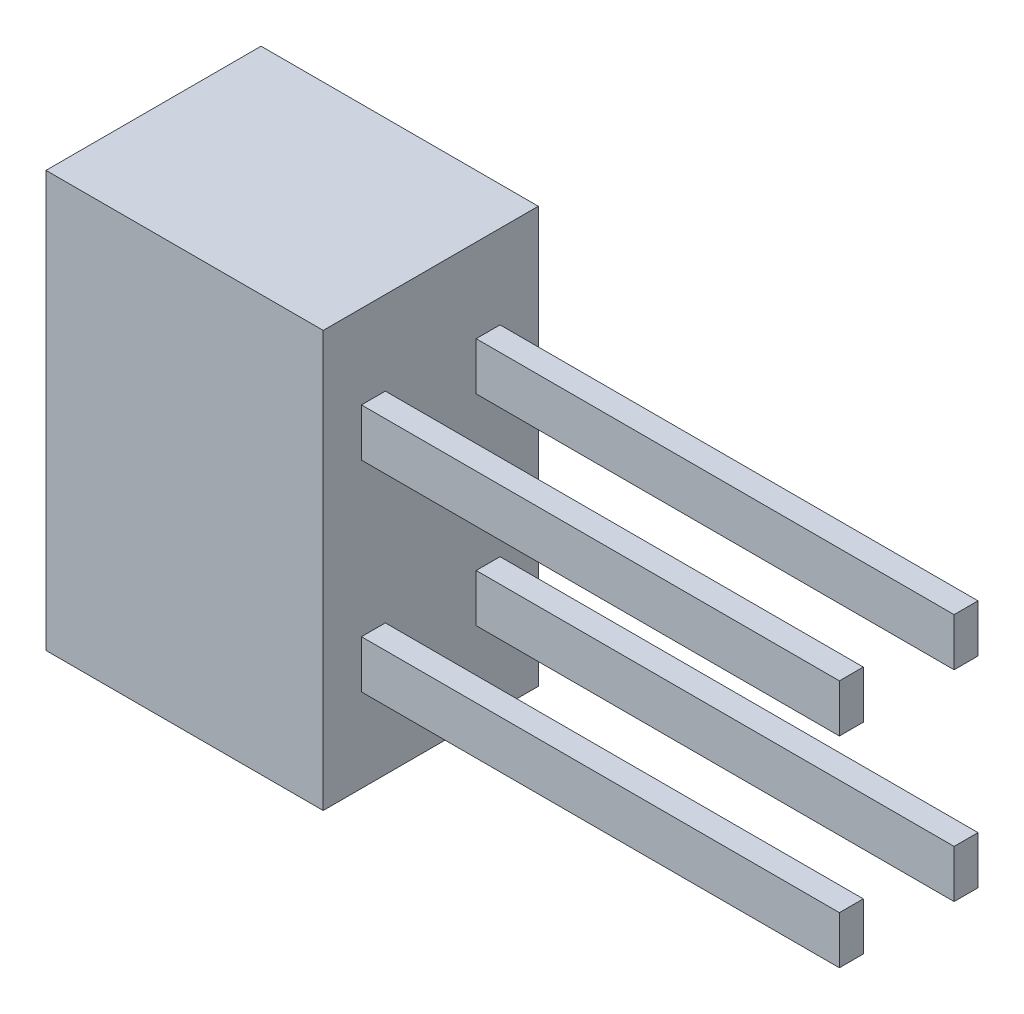
ISO-10303-21;
HEADER;
FILE_DESCRIPTION(('STEP AP214'),'2;1');
FILE_NAME('part.step','',(''),(''),'','','');
FILE_SCHEMA(('AUTOMOTIVE_DESIGN { 1 0 10303 214 1 1 1 1 }'));
ENDSEC;
DATA;
#1=APPLICATION_CONTEXT('core data for automotive mechanical design processes');
#2=APPLICATION_PROTOCOL_DEFINITION('international standard','automotive_design',2000,#1);
#3=PRODUCT_CONTEXT('',#1,'mechanical');
#4=PRODUCT('Part','Part','',(#3));
#5=PRODUCT_RELATED_PRODUCT_CATEGORY('part','',(#4));
#6=PRODUCT_DEFINITION_FORMATION('','',#4);
#7=PRODUCT_DEFINITION_CONTEXT('part definition',#1,'design');
#8=PRODUCT_DEFINITION('design','',#6,#7);
#9=PRODUCT_DEFINITION_SHAPE('','',#8);
#10=(LENGTH_UNIT() NAMED_UNIT(*) SI_UNIT(.MILLI.,.METRE.));
#11=(NAMED_UNIT(*) PLANE_ANGLE_UNIT() SI_UNIT($,.RADIAN.));
#12=(NAMED_UNIT(*) SI_UNIT($,.STERADIAN.) SOLID_ANGLE_UNIT());
#13=UNCERTAINTY_MEASURE_WITH_UNIT(LENGTH_MEASURE(1.E-05),#10,'distance_accuracy_value','');
#14=(GEOMETRIC_REPRESENTATION_CONTEXT(3) GLOBAL_UNCERTAINTY_ASSIGNED_CONTEXT((#13)) GLOBAL_UNIT_ASSIGNED_CONTEXT((#10,
#11,#12)) REPRESENTATION_CONTEXT('',''));
#15=CARTESIAN_POINT('',(0.,0.,0.));
#16=DIRECTION('',(0.,0.,1.));
#17=DIRECTION('',(1.,0.,0.));
#18=AXIS2_PLACEMENT_3D('',#15,#16,#17);
#19=CARTESIAN_POINT('',(5.8,0.,0.));
#20=DIRECTION('',(-1.,0.,0.));
#21=DIRECTION('',(0.,0.,1.));
#22=AXIS2_PLACEMENT_3D('',#19,#20,#21);
#23=PLANE('',#22);
#24=DIRECTION('',(0.,-1.,0.));
#25=VECTOR('',#24,1.);
#26=CARTESIAN_POINT('',(5.8,2.6,-0.95));
#27=LINE('',#26,#25);
#28=CARTESIAN_POINT('',(5.8,2.6,-0.95));
#29=VERTEX_POINT('',#28);
#30=CARTESIAN_POINT('',(5.8,1.6,-0.95));
#31=VERTEX_POINT('',#30);
#32=EDGE_CURVE('E192',#29,#31,#27,.T.);
#33=ORIENTED_EDGE('',*,*,#32,.F.);
#34=DIRECTION('',(0.,0.,1.));
#35=VECTOR('',#34,1.);
#36=CARTESIAN_POINT('',(5.8,2.6,-0.95));
#37=LINE('',#36,#35);
#38=CARTESIAN_POINT('',(5.8,2.6,-1.45));
#39=VERTEX_POINT('',#38);
#40=EDGE_CURVE('E205',#39,#29,#37,.T.);
#41=ORIENTED_EDGE('',*,*,#40,.F.);
#42=DIRECTION('',(0.,1.,0.));
#43=VECTOR('',#42,1.);
#44=CARTESIAN_POINT('',(5.8,2.6,-1.45));
#45=LINE('',#44,#43);
#46=CARTESIAN_POINT('',(5.8,1.6,-1.45));
#47=VERTEX_POINT('',#46);
#48=EDGE_CURVE('E214',#47,#39,#45,.T.);
#49=ORIENTED_EDGE('',*,*,#48,.F.);
#50=DIRECTION('',(0.,0.,-1.));
#51=VECTOR('',#50,1.);
#52=CARTESIAN_POINT('',(5.8,1.6,-0.95));
#53=LINE('',#52,#51);
#54=EDGE_CURVE('E195',#31,#47,#53,.T.);
#55=ORIENTED_EDGE('',*,*,#54,.F.);
#56=EDGE_LOOP('',(#33,#41,#49,#55));
#57=FACE_BOUND('',#56,.T.);
#58=DIRECTION('',(0.,1.,0.));
#59=VECTOR('',#58,1.);
#60=CARTESIAN_POINT('',(5.8,-2.6,0.95));
#61=LINE('',#60,#59);
#62=CARTESIAN_POINT('',(5.8,-2.6,0.95));
#63=VERTEX_POINT('',#62);
#64=CARTESIAN_POINT('',(5.8,-1.6,0.949999999999999));
#65=VERTEX_POINT('',#64);
#66=EDGE_CURVE('E263',#63,#65,#61,.T.);
#67=ORIENTED_EDGE('',*,*,#66,.F.);
#68=DIRECTION('',(0.,0.,-1.));
#69=VECTOR('',#68,1.);
#70=CARTESIAN_POINT('',(5.8,-2.6,0.95));
#71=LINE('',#70,#69);
#72=CARTESIAN_POINT('',(5.8,-2.6,1.45));
#73=VERTEX_POINT('',#72);
#74=EDGE_CURVE('E268',#73,#63,#71,.T.);
#75=ORIENTED_EDGE('',*,*,#74,.F.);
#76=DIRECTION('',(0.,-1.,0.));
#77=VECTOR('',#76,1.);
#78=CARTESIAN_POINT('',(5.8,-2.6,1.45));
#79=LINE('',#78,#77);
#80=CARTESIAN_POINT('',(5.8,-1.6,1.45));
#81=VERTEX_POINT('',#80);
#82=EDGE_CURVE('E280',#81,#73,#79,.T.);
#83=ORIENTED_EDGE('',*,*,#82,.F.);
#84=DIRECTION('',(0.,0.,1.));
#85=VECTOR('',#84,1.);
#86=CARTESIAN_POINT('',(5.8,-1.6,0.949999999999999));
#87=LINE('',#86,#85);
#88=EDGE_CURVE('E277',#65,#81,#87,.T.);
#89=ORIENTED_EDGE('',*,*,#88,.F.);
#90=EDGE_LOOP('',(#67,#75,#83,#89));
#91=FACE_BOUND('',#90,.T.);
#92=DIRECTION('',(0.,1.,0.));
#93=VECTOR('',#92,1.);
#94=CARTESIAN_POINT('',(5.8,-4.35,-2.25));
#95=LINE('',#94,#93);
#96=CARTESIAN_POINT('',(5.8,-4.35,-2.25));
#97=VERTEX_POINT('',#96);
#98=CARTESIAN_POINT('',(5.8,4.35,-2.25));
#99=VERTEX_POINT('',#98);
#100=EDGE_CURVE('E297',#97,#99,#95,.T.);
#101=ORIENTED_EDGE('',*,*,#100,.T.);
#102=DIRECTION('',(0.,0.,1.));
#103=VECTOR('',#102,1.);
#104=CARTESIAN_POINT('',(5.8,4.35,2.25));
#105=LINE('',#104,#103);
#106=CARTESIAN_POINT('',(5.8,4.35,2.25));
#107=VERTEX_POINT('',#106);
#108=EDGE_CURVE('E300',#99,#107,#105,.T.);
#109=ORIENTED_EDGE('',*,*,#108,.T.);
#110=DIRECTION('',(0.,-1.,0.));
#111=VECTOR('',#110,1.);
#112=CARTESIAN_POINT('',(5.8,-4.35,2.25));
#113=LINE('',#112,#111);
#114=CARTESIAN_POINT('',(5.8,-4.35,2.25));
#115=VERTEX_POINT('',#114);
#116=EDGE_CURVE('E303',#107,#115,#113,.T.);
#117=ORIENTED_EDGE('',*,*,#116,.T.);
#118=DIRECTION('',(0.,0.,-1.));
#119=VECTOR('',#118,1.);
#120=CARTESIAN_POINT('',(5.8,-4.35,2.25));
#121=LINE('',#120,#119);
#122=EDGE_CURVE('E305',#115,#97,#121,.T.);
#123=ORIENTED_EDGE('',*,*,#122,.T.);
#124=EDGE_LOOP('',(#101,#109,#117,#123));
#125=FACE_BOUND('',#124,.T.);
#126=DIRECTION('',(0.,0.,1.));
#127=VECTOR('',#126,1.);
#128=CARTESIAN_POINT('',(5.8,2.6,0.95));
#129=LINE('',#128,#127);
#130=CARTESIAN_POINT('',(5.8,2.6,0.95));
#131=VERTEX_POINT('',#130);
#132=CARTESIAN_POINT('',(5.8,2.6,1.45));
#133=VERTEX_POINT('',#132);
#134=EDGE_CURVE('E230',#131,#133,#129,.T.);
#135=ORIENTED_EDGE('',*,*,#134,.F.);
#136=DIRECTION('',(0.,1.,0.));
#137=VECTOR('',#136,1.);
#138=CARTESIAN_POINT('',(5.8,2.6,0.95));
#139=LINE('',#138,#137);
#140=CARTESIAN_POINT('',(5.8,1.6,0.949999999999999));
#141=VERTEX_POINT('',#140);
#142=EDGE_CURVE('E235',#141,#131,#139,.T.);
#143=ORIENTED_EDGE('',*,*,#142,.F.);
#144=DIRECTION('',(0.,0.,-1.));
#145=VECTOR('',#144,1.);
#146=CARTESIAN_POINT('',(5.8,1.6,0.949999999999999));
#147=LINE('',#146,#145);
#148=CARTESIAN_POINT('',(5.8,1.6,1.45));
#149=VERTEX_POINT('',#148);
#150=EDGE_CURVE('E247',#149,#141,#147,.T.);
#151=ORIENTED_EDGE('',*,*,#150,.F.);
#152=DIRECTION('',(0.,-1.,0.));
#153=VECTOR('',#152,1.);
#154=CARTESIAN_POINT('',(5.8,2.6,1.45));
#155=LINE('',#154,#153);
#156=EDGE_CURVE('E244',#133,#149,#155,.T.);
#157=ORIENTED_EDGE('',*,*,#156,.F.);
#158=EDGE_LOOP('',(#135,#143,#151,#157));
#159=FACE_BOUND('',#158,.T.);
#160=DIRECTION('',(0.,0.,-1.));
#161=VECTOR('',#160,1.);
#162=CARTESIAN_POINT('',(5.8,-2.6,-0.95));
#163=LINE('',#162,#161);
#164=CARTESIAN_POINT('',(5.8,-2.6,-0.95));
#165=VERTEX_POINT('',#164);
#166=CARTESIAN_POINT('',(5.8,-2.6,-1.45));
#167=VERTEX_POINT('',#166);
#168=EDGE_CURVE('E191',#165,#167,#163,.T.);
#169=ORIENTED_EDGE('',*,*,#168,.F.);
#170=DIRECTION('',(0.,-1.,0.));
#171=VECTOR('',#170,1.);
#172=CARTESIAN_POINT('',(5.8,-2.6,-0.95));
#173=LINE('',#172,#171);
#174=CARTESIAN_POINT('',(5.8,-1.6,-0.95));
#175=VERTEX_POINT('',#174);
#176=EDGE_CURVE('E188',#175,#165,#173,.T.);
#177=ORIENTED_EDGE('',*,*,#176,.F.);
#178=DIRECTION('',(0.,0.,1.));
#179=VECTOR('',#178,1.);
#180=CARTESIAN_POINT('',(5.8,-1.6,-0.95));
#181=LINE('',#180,#179);
#182=CARTESIAN_POINT('',(5.8,-1.6,-1.45));
#183=VERTEX_POINT('',#182);
#184=EDGE_CURVE('E54',#183,#175,#181,.T.);
#185=ORIENTED_EDGE('',*,*,#184,.F.);
#186=DIRECTION('',(0.,1.,0.));
#187=VECTOR('',#186,1.);
#188=CARTESIAN_POINT('',(5.8,-2.6,-1.45));
#189=LINE('',#188,#187);
#190=EDGE_CURVE('E49',#167,#183,#189,.T.);
#191=ORIENTED_EDGE('',*,*,#190,.F.);
#192=EDGE_LOOP('',(#169,#177,#185,#191));
#193=FACE_BOUND('',#192,.T.);
#194=ADVANCED_FACE('F34',(#57,#91,#125,#159,#193),#23,.F.);
#195=CARTESIAN_POINT('',(5.8,-4.35,-2.25));
#196=DIRECTION('',(0.,0.,1.));
#197=DIRECTION('',(1.,0.,0.));
#198=AXIS2_PLACEMENT_3D('',#195,#196,#197);
#199=PLANE('',#198);
#200=DIRECTION('',(0.,1.,0.));
#201=VECTOR('',#200,1.);
#202=CARTESIAN_POINT('',(0.,-4.35,-2.25));
#203=LINE('',#202,#201);
#204=CARTESIAN_POINT('',(0.,-4.35,-2.25));
#205=VERTEX_POINT('',#204);
#206=CARTESIAN_POINT('',(0.,4.35,-2.25));
#207=VERTEX_POINT('',#206);
#208=EDGE_CURVE('E296',#205,#207,#203,.T.);
#209=ORIENTED_EDGE('',*,*,#208,.T.);
#210=DIRECTION('',(-1.,0.,0.));
#211=VECTOR('',#210,1.);
#212=CARTESIAN_POINT('',(5.8,4.35,-2.25));
#213=LINE('',#212,#211);
#214=EDGE_CURVE('E11',#99,#207,#213,.T.);
#215=ORIENTED_EDGE('',*,*,#214,.F.);
#216=ORIENTED_EDGE('',*,*,#100,.F.);
#217=DIRECTION('',(-1.,0.,0.));
#218=VECTOR('',#217,1.);
#219=CARTESIAN_POINT('',(5.8,-4.35,-2.25));
#220=LINE('',#219,#218);
#221=EDGE_CURVE('E307',#97,#205,#220,.T.);
#222=ORIENTED_EDGE('',*,*,#221,.T.);
#223=EDGE_LOOP('',(#209,#215,#216,#222));
#224=FACE_BOUND('',#223,.T.);
#225=ADVANCED_FACE('F36',(#224),#199,.F.);
#226=CARTESIAN_POINT('',(5.8,4.35,2.25));
#227=DIRECTION('',(0.,-1.,0.));
#228=DIRECTION('',(0.,0.,-1.));
#229=AXIS2_PLACEMENT_3D('',#226,#227,#228);
#230=PLANE('',#229);
#231=DIRECTION('',(0.,0.,1.));
#232=VECTOR('',#231,1.);
#233=CARTESIAN_POINT('',(0.,4.35,2.25));
#234=LINE('',#233,#232);
#235=CARTESIAN_POINT('',(0.,4.35,2.25));
#236=VERTEX_POINT('',#235);
#237=EDGE_CURVE('E310',#207,#236,#234,.T.);
#238=ORIENTED_EDGE('',*,*,#237,.T.);
#239=DIRECTION('',(-1.,0.,0.));
#240=VECTOR('',#239,1.);
#241=CARTESIAN_POINT('',(5.8,4.35,2.25));
#242=LINE('',#241,#240);
#243=EDGE_CURVE('E42',#107,#236,#242,.T.);
#244=ORIENTED_EDGE('',*,*,#243,.F.);
#245=ORIENTED_EDGE('',*,*,#108,.F.);
#246=ORIENTED_EDGE('',*,*,#214,.T.);
#247=EDGE_LOOP('',(#238,#244,#245,#246));
#248=FACE_BOUND('',#247,.T.);
#249=ADVANCED_FACE('F340',(#248),#230,.F.);
#250=CARTESIAN_POINT('',(5.8,-4.35,2.25));
#251=DIRECTION('',(0.,0.,-1.));
#252=DIRECTION('',(-1.,0.,0.));
#253=AXIS2_PLACEMENT_3D('',#250,#251,#252);
#254=PLANE('',#253);
#255=DIRECTION('',(0.,-1.,0.));
#256=VECTOR('',#255,1.);
#257=CARTESIAN_POINT('',(0.,-4.35,2.25));
#258=LINE('',#257,#256);
#259=CARTESIAN_POINT('',(0.,-4.35,2.25));
#260=VERTEX_POINT('',#259);
#261=EDGE_CURVE('E312',#236,#260,#258,.T.);
#262=ORIENTED_EDGE('',*,*,#261,.T.);
#263=DIRECTION('',(-1.,0.,0.));
#264=VECTOR('',#263,1.);
#265=CARTESIAN_POINT('',(5.8,-4.35,2.25));
#266=LINE('',#265,#264);
#267=EDGE_CURVE('E317',#115,#260,#266,.T.);
#268=ORIENTED_EDGE('',*,*,#267,.F.);
#269=ORIENTED_EDGE('',*,*,#116,.F.);
#270=ORIENTED_EDGE('',*,*,#243,.T.);
#271=EDGE_LOOP('',(#262,#268,#269,#270));
#272=FACE_BOUND('',#271,.T.);
#273=ADVANCED_FACE('F324',(#272),#254,.F.);
#274=CARTESIAN_POINT('',(5.8,-4.35,2.25));
#275=DIRECTION('',(0.,1.,0.));
#276=DIRECTION('',(0.,0.,1.));
#277=AXIS2_PLACEMENT_3D('',#274,#275,#276);
#278=PLANE('',#277);
#279=DIRECTION('',(0.,0.,-1.));
#280=VECTOR('',#279,1.);
#281=CARTESIAN_POINT('',(0.,-4.35,2.25));
#282=LINE('',#281,#280);
#283=EDGE_CURVE('E301',#260,#205,#282,.T.);
#284=ORIENTED_EDGE('',*,*,#283,.T.);
#285=ORIENTED_EDGE('',*,*,#221,.F.);
#286=ORIENTED_EDGE('',*,*,#122,.F.);
#287=ORIENTED_EDGE('',*,*,#267,.T.);
#288=EDGE_LOOP('',(#284,#285,#286,#287));
#289=FACE_BOUND('',#288,.T.);
#290=ADVANCED_FACE('F333',(#289),#278,.F.);
#291=CARTESIAN_POINT('',(0.,0.,0.));
#292=DIRECTION('',(-1.,0.,0.));
#293=DIRECTION('',(0.,0.,1.));
#294=AXIS2_PLACEMENT_3D('',#291,#292,#293);
#295=PLANE('',#294);
#296=ORIENTED_EDGE('',*,*,#208,.F.);
#297=ORIENTED_EDGE('',*,*,#283,.F.);
#298=ORIENTED_EDGE('',*,*,#261,.F.);
#299=ORIENTED_EDGE('',*,*,#237,.F.);
#300=EDGE_LOOP('',(#296,#297,#298,#299));
#301=FACE_BOUND('',#300,.T.);
#302=ADVANCED_FACE('F330',(#301),#295,.T.);
#303=CARTESIAN_POINT('',(15.8,-2.6,0.95));
#304=DIRECTION('',(0.,0.,1.));
#305=DIRECTION('',(0.,-1.,0.));
#306=AXIS2_PLACEMENT_3D('',#303,#304,#305);
#307=PLANE('',#306);
#308=ORIENTED_EDGE('',*,*,#66,.T.);
#309=DIRECTION('',(-1.,0.,0.));
#310=VECTOR('',#309,1.);
#311=CARTESIAN_POINT('',(15.8,-1.6,0.949999999999999));
#312=LINE('',#311,#310);
#313=CARTESIAN_POINT('',(15.8,-1.6,0.949999999999999));
#314=VERTEX_POINT('',#313);
#315=EDGE_CURVE('E293',#314,#65,#312,.T.);
#316=ORIENTED_EDGE('',*,*,#315,.F.);
#317=DIRECTION('',(0.,1.,0.));
#318=VECTOR('',#317,1.);
#319=CARTESIAN_POINT('',(15.8,-2.6,0.95));
#320=LINE('',#319,#318);
#321=CARTESIAN_POINT('',(15.8,-2.6,0.95));
#322=VERTEX_POINT('',#321);
#323=EDGE_CURVE('E264',#322,#314,#320,.T.);
#324=ORIENTED_EDGE('',*,*,#323,.F.);
#325=DIRECTION('',(-1.,0.,0.));
#326=VECTOR('',#325,1.);
#327=CARTESIAN_POINT('',(15.8,-2.6,0.95));
#328=LINE('',#327,#326);
#329=EDGE_CURVE('E274',#322,#63,#328,.T.);
#330=ORIENTED_EDGE('',*,*,#329,.T.);
#331=EDGE_LOOP('',(#308,#316,#324,#330));
#332=FACE_BOUND('',#331,.T.);
#333=ADVANCED_FACE('F355',(#332),#307,.F.);
#334=CARTESIAN_POINT('',(15.8,-1.6,0.949999999999999));
#335=DIRECTION('',(0.,-1.,0.));
#336=DIRECTION('',(0.,0.,-1.));
#337=AXIS2_PLACEMENT_3D('',#334,#335,#336);
#338=PLANE('',#337);
#339=ORIENTED_EDGE('',*,*,#88,.T.);
#340=DIRECTION('',(-1.,0.,0.));
#341=VECTOR('',#340,1.);
#342=CARTESIAN_POINT('',(15.8,-1.6,1.45));
#343=LINE('',#342,#341);
#344=CARTESIAN_POINT('',(15.8,-1.6,1.45));
#345=VERTEX_POINT('',#344);
#346=EDGE_CURVE('E290',#345,#81,#343,.T.);
#347=ORIENTED_EDGE('',*,*,#346,.F.);
#348=DIRECTION('',(0.,0.,1.));
#349=VECTOR('',#348,1.);
#350=CARTESIAN_POINT('',(15.8,-1.6,0.949999999999999));
#351=LINE('',#350,#349);
#352=EDGE_CURVE('E267',#314,#345,#351,.T.);
#353=ORIENTED_EDGE('',*,*,#352,.F.);
#354=ORIENTED_EDGE('',*,*,#315,.T.);
#355=EDGE_LOOP('',(#339,#347,#353,#354));
#356=FACE_BOUND('',#355,.T.);
#357=ADVANCED_FACE('F374',(#356),#338,.F.);
#358=CARTESIAN_POINT('',(15.8,-2.6,1.45));
#359=DIRECTION('',(0.,0.,-1.));
#360=DIRECTION('',(0.,1.,0.));
#361=AXIS2_PLACEMENT_3D('',#358,#359,#360);
#362=PLANE('',#361);
#363=ORIENTED_EDGE('',*,*,#82,.T.);
#364=DIRECTION('',(-1.,0.,0.));
#365=VECTOR('',#364,1.);
#366=CARTESIAN_POINT('',(15.8,-2.6,1.45));
#367=LINE('',#366,#365);
#368=CARTESIAN_POINT('',(15.8,-2.6,1.45));
#369=VERTEX_POINT('',#368);
#370=EDGE_CURVE('E287',#369,#73,#367,.T.);
#371=ORIENTED_EDGE('',*,*,#370,.F.);
#372=DIRECTION('',(0.,-1.,0.));
#373=VECTOR('',#372,1.);
#374=CARTESIAN_POINT('',(15.8,-2.6,1.45));
#375=LINE('',#374,#373);
#376=EDGE_CURVE('E270',#345,#369,#375,.T.);
#377=ORIENTED_EDGE('',*,*,#376,.F.);
#378=ORIENTED_EDGE('',*,*,#346,.T.);
#379=EDGE_LOOP('',(#363,#371,#377,#378));
#380=FACE_BOUND('',#379,.T.);
#381=ADVANCED_FACE('F381',(#380),#362,.F.);
#382=CARTESIAN_POINT('',(15.8,-2.6,0.95));
#383=DIRECTION('',(0.,1.,0.));
#384=DIRECTION('',(0.,0.,1.));
#385=AXIS2_PLACEMENT_3D('',#382,#383,#384);
#386=PLANE('',#385);
#387=ORIENTED_EDGE('',*,*,#74,.T.);
#388=ORIENTED_EDGE('',*,*,#329,.F.);
#389=DIRECTION('',(0.,0.,-1.));
#390=VECTOR('',#389,1.);
#391=CARTESIAN_POINT('',(15.8,-2.6,0.95));
#392=LINE('',#391,#390);
#393=EDGE_CURVE('E272',#369,#322,#392,.T.);
#394=ORIENTED_EDGE('',*,*,#393,.F.);
#395=ORIENTED_EDGE('',*,*,#370,.T.);
#396=EDGE_LOOP('',(#387,#388,#394,#395));
#397=FACE_BOUND('',#396,.T.);
#398=ADVANCED_FACE('F388',(#397),#386,.F.);
#399=CARTESIAN_POINT('',(15.8,0.,0.));
#400=DIRECTION('',(1.,0.,0.));
#401=DIRECTION('',(0.,0.,-1.));
#402=AXIS2_PLACEMENT_3D('',#399,#400,#401);
#403=PLANE('',#402);
#404=ORIENTED_EDGE('',*,*,#323,.T.);
#405=ORIENTED_EDGE('',*,*,#352,.T.);
#406=ORIENTED_EDGE('',*,*,#376,.T.);
#407=ORIENTED_EDGE('',*,*,#393,.T.);
#408=EDGE_LOOP('',(#404,#405,#406,#407));
#409=FACE_BOUND('',#408,.T.);
#410=ADVANCED_FACE('F396',(#409),#403,.T.);
#411=CARTESIAN_POINT('',(15.8,2.6,0.95));
#412=DIRECTION('',(0.,-1.,0.));
#413=DIRECTION('',(0.,0.,-1.));
#414=AXIS2_PLACEMENT_3D('',#411,#412,#413);
#415=PLANE('',#414);
#416=ORIENTED_EDGE('',*,*,#134,.T.);
#417=DIRECTION('',(-1.,0.,0.));
#418=VECTOR('',#417,1.);
#419=CARTESIAN_POINT('',(15.8,2.6,1.45));
#420=LINE('',#419,#418);
#421=CARTESIAN_POINT('',(15.8,2.6,1.45));
#422=VERTEX_POINT('',#421);
#423=EDGE_CURVE('E260',#422,#133,#420,.T.);
#424=ORIENTED_EDGE('',*,*,#423,.F.);
#425=DIRECTION('',(0.,0.,1.));
#426=VECTOR('',#425,1.);
#427=CARTESIAN_POINT('',(15.8,2.6,0.95));
#428=LINE('',#427,#426);
#429=CARTESIAN_POINT('',(15.8,2.6,0.95));
#430=VERTEX_POINT('',#429);
#431=EDGE_CURVE('E231',#430,#422,#428,.T.);
#432=ORIENTED_EDGE('',*,*,#431,.F.);
#433=DIRECTION('',(-1.,0.,0.));
#434=VECTOR('',#433,1.);
#435=CARTESIAN_POINT('',(15.8,2.6,0.95));
#436=LINE('',#435,#434);
#437=EDGE_CURVE('E241',#430,#131,#436,.T.);
#438=ORIENTED_EDGE('',*,*,#437,.T.);
#439=EDGE_LOOP('',(#416,#424,#432,#438));
#440=FACE_BOUND('',#439,.T.);
#441=ADVANCED_FACE('F404',(#440),#415,.F.);
#442=CARTESIAN_POINT('',(15.8,2.6,1.45));
#443=DIRECTION('',(0.,0.,-1.));
#444=DIRECTION('',(0.,1.,0.));
#445=AXIS2_PLACEMENT_3D('',#442,#443,#444);
#446=PLANE('',#445);
#447=ORIENTED_EDGE('',*,*,#156,.T.);
#448=DIRECTION('',(-1.,0.,0.));
#449=VECTOR('',#448,1.);
#450=CARTESIAN_POINT('',(15.8,1.6,1.45));
#451=LINE('',#450,#449);
#452=CARTESIAN_POINT('',(15.8,1.6,1.45));
#453=VERTEX_POINT('',#452);
#454=EDGE_CURVE('E257',#453,#149,#451,.T.);
#455=ORIENTED_EDGE('',*,*,#454,.F.);
#456=DIRECTION('',(0.,-1.,0.));
#457=VECTOR('',#456,1.);
#458=CARTESIAN_POINT('',(15.8,2.6,1.45));
#459=LINE('',#458,#457);
#460=EDGE_CURVE('E234',#422,#453,#459,.T.);
#461=ORIENTED_EDGE('',*,*,#460,.F.);
#462=ORIENTED_EDGE('',*,*,#423,.T.);
#463=EDGE_LOOP('',(#447,#455,#461,#462));
#464=FACE_BOUND('',#463,.T.);
#465=ADVANCED_FACE('F412',(#464),#446,.F.);
#466=CARTESIAN_POINT('',(15.8,1.6,0.949999999999999));
#467=DIRECTION('',(0.,1.,0.));
#468=DIRECTION('',(0.,0.,1.));
#469=AXIS2_PLACEMENT_3D('',#466,#467,#468);
#470=PLANE('',#469);
#471=ORIENTED_EDGE('',*,*,#150,.T.);
#472=DIRECTION('',(-1.,0.,0.));
#473=VECTOR('',#472,1.);
#474=CARTESIAN_POINT('',(15.8,1.6,0.949999999999999));
#475=LINE('',#474,#473);
#476=CARTESIAN_POINT('',(15.8,1.6,0.949999999999999));
#477=VERTEX_POINT('',#476);
#478=EDGE_CURVE('E254',#477,#141,#475,.T.);
#479=ORIENTED_EDGE('',*,*,#478,.F.);
#480=DIRECTION('',(0.,0.,-1.));
#481=VECTOR('',#480,1.);
#482=CARTESIAN_POINT('',(15.8,1.6,0.949999999999999));
#483=LINE('',#482,#481);
#484=EDGE_CURVE('E237',#453,#477,#483,.T.);
#485=ORIENTED_EDGE('',*,*,#484,.F.);
#486=ORIENTED_EDGE('',*,*,#454,.T.);
#487=EDGE_LOOP('',(#471,#479,#485,#486));
#488=FACE_BOUND('',#487,.T.);
#489=ADVANCED_FACE('F420',(#488),#470,.F.);
#490=CARTESIAN_POINT('',(15.8,2.6,0.95));
#491=DIRECTION('',(0.,0.,1.));
#492=DIRECTION('',(0.,-1.,0.));
#493=AXIS2_PLACEMENT_3D('',#490,#491,#492);
#494=PLANE('',#493);
#495=ORIENTED_EDGE('',*,*,#142,.T.);
#496=ORIENTED_EDGE('',*,*,#437,.F.);
#497=DIRECTION('',(0.,1.,0.));
#498=VECTOR('',#497,1.);
#499=CARTESIAN_POINT('',(15.8,2.6,0.95));
#500=LINE('',#499,#498);
#501=EDGE_CURVE('E239',#477,#430,#500,.T.);
#502=ORIENTED_EDGE('',*,*,#501,.F.);
#503=ORIENTED_EDGE('',*,*,#478,.T.);
#504=EDGE_LOOP('',(#495,#496,#502,#503));
#505=FACE_BOUND('',#504,.T.);
#506=ADVANCED_FACE('F428',(#505),#494,.F.);
#507=CARTESIAN_POINT('',(15.8,0.,0.));
#508=DIRECTION('',(1.,0.,0.));
#509=DIRECTION('',(0.,0.,-1.));
#510=AXIS2_PLACEMENT_3D('',#507,#508,#509);
#511=PLANE('',#510);
#512=ORIENTED_EDGE('',*,*,#431,.T.);
#513=ORIENTED_EDGE('',*,*,#460,.T.);
#514=ORIENTED_EDGE('',*,*,#484,.T.);
#515=ORIENTED_EDGE('',*,*,#501,.T.);
#516=EDGE_LOOP('',(#512,#513,#514,#515));
#517=FACE_BOUND('',#516,.T.);
#518=ADVANCED_FACE('F436',(#517),#511,.T.);
#519=CARTESIAN_POINT('',(15.8,2.6,-0.95));
#520=DIRECTION('',(0.,0.,-1.));
#521=DIRECTION('',(-1.,0.,0.));
#522=AXIS2_PLACEMENT_3D('',#519,#520,#521);
#523=PLANE('',#522);
#524=ORIENTED_EDGE('',*,*,#32,.T.);
#525=DIRECTION('',(-1.,0.,0.));
#526=VECTOR('',#525,1.);
#527=CARTESIAN_POINT('',(15.8,1.6,-0.95));
#528=LINE('',#527,#526);
#529=CARTESIAN_POINT('',(15.8,1.6,-0.95));
#530=VERTEX_POINT('',#529);
#531=EDGE_CURVE('E227',#530,#31,#528,.T.);
#532=ORIENTED_EDGE('',*,*,#531,.F.);
#533=DIRECTION('',(0.,-1.,0.));
#534=VECTOR('',#533,1.);
#535=CARTESIAN_POINT('',(15.8,2.6,-0.95));
#536=LINE('',#535,#534);
#537=CARTESIAN_POINT('',(15.8,2.6,-0.95));
#538=VERTEX_POINT('',#537);
#539=EDGE_CURVE('E201',#538,#530,#536,.T.);
#540=ORIENTED_EDGE('',*,*,#539,.F.);
#541=DIRECTION('',(-1.,0.,0.));
#542=VECTOR('',#541,1.);
#543=CARTESIAN_POINT('',(15.8,2.6,-0.95));
#544=LINE('',#543,#542);
#545=EDGE_CURVE('E210',#538,#29,#544,.T.);
#546=ORIENTED_EDGE('',*,*,#545,.T.);
#547=EDGE_LOOP('',(#524,#532,#540,#546));
#548=FACE_BOUND('',#547,.T.);
#549=ADVANCED_FACE('F444',(#548),#523,.F.);
#550=CARTESIAN_POINT('',(15.8,1.6,-0.95));
#551=DIRECTION('',(0.,1.,0.));
#552=DIRECTION('',(0.,0.,1.));
#553=AXIS2_PLACEMENT_3D('',#550,#551,#552);
#554=PLANE('',#553);
#555=ORIENTED_EDGE('',*,*,#54,.T.);
#556=DIRECTION('',(-1.,0.,0.));
#557=VECTOR('',#556,1.);
#558=CARTESIAN_POINT('',(15.8,1.6,-1.45));
#559=LINE('',#558,#557);
#560=CARTESIAN_POINT('',(15.8,1.6,-1.45));
#561=VERTEX_POINT('',#560);
#562=EDGE_CURVE('E224',#561,#47,#559,.T.);
#563=ORIENTED_EDGE('',*,*,#562,.F.);
#564=DIRECTION('',(0.,0.,-1.));
#565=VECTOR('',#564,1.);
#566=CARTESIAN_POINT('',(15.8,1.6,-0.95));
#567=LINE('',#566,#565);
#568=EDGE_CURVE('E204',#530,#561,#567,.T.);
#569=ORIENTED_EDGE('',*,*,#568,.F.);
#570=ORIENTED_EDGE('',*,*,#531,.T.);
#571=EDGE_LOOP('',(#555,#563,#569,#570));
#572=FACE_BOUND('',#571,.T.);
#573=ADVANCED_FACE('F452',(#572),#554,.F.);
#574=CARTESIAN_POINT('',(15.8,2.6,-1.45));
#575=DIRECTION('',(0.,0.,1.));
#576=DIRECTION('',(1.,0.,0.));
#577=AXIS2_PLACEMENT_3D('',#574,#575,#576);
#578=PLANE('',#577);
#579=ORIENTED_EDGE('',*,*,#48,.T.);
#580=DIRECTION('',(-1.,0.,0.));
#581=VECTOR('',#580,1.);
#582=CARTESIAN_POINT('',(15.8,2.6,-1.45));
#583=LINE('',#582,#581);
#584=CARTESIAN_POINT('',(15.8,2.6,-1.45));
#585=VERTEX_POINT('',#584);
#586=EDGE_CURVE('E221',#585,#39,#583,.T.);
#587=ORIENTED_EDGE('',*,*,#586,.F.);
#588=DIRECTION('',(0.,1.,0.));
#589=VECTOR('',#588,1.);
#590=CARTESIAN_POINT('',(15.8,2.6,-1.45));
#591=LINE('',#590,#589);
#592=EDGE_CURVE('E207',#561,#585,#591,.T.);
#593=ORIENTED_EDGE('',*,*,#592,.F.);
#594=ORIENTED_EDGE('',*,*,#562,.T.);
#595=EDGE_LOOP('',(#579,#587,#593,#594));
#596=FACE_BOUND('',#595,.T.);
#597=ADVANCED_FACE('F460',(#596),#578,.F.);
#598=CARTESIAN_POINT('',(15.8,2.6,-0.95));
#599=DIRECTION('',(0.,-1.,0.));
#600=DIRECTION('',(0.,0.,-1.));
#601=AXIS2_PLACEMENT_3D('',#598,#599,#600);
#602=PLANE('',#601);
#603=ORIENTED_EDGE('',*,*,#40,.T.);
#604=ORIENTED_EDGE('',*,*,#545,.F.);
#605=DIRECTION('',(0.,0.,1.));
#606=VECTOR('',#605,1.);
#607=CARTESIAN_POINT('',(15.8,2.6,-0.95));
#608=LINE('',#607,#606);
#609=EDGE_CURVE('E209',#585,#538,#608,.T.);
#610=ORIENTED_EDGE('',*,*,#609,.F.);
#611=ORIENTED_EDGE('',*,*,#586,.T.);
#612=EDGE_LOOP('',(#603,#604,#610,#611));
#613=FACE_BOUND('',#612,.T.);
#614=ADVANCED_FACE('F468',(#613),#602,.F.);
#615=CARTESIAN_POINT('',(15.8,0.,0.));
#616=DIRECTION('',(1.,0.,0.));
#617=DIRECTION('',(0.,0.,-1.));
#618=AXIS2_PLACEMENT_3D('',#615,#616,#617);
#619=PLANE('',#618);
#620=ORIENTED_EDGE('',*,*,#539,.T.);
#621=ORIENTED_EDGE('',*,*,#568,.T.);
#622=ORIENTED_EDGE('',*,*,#592,.T.);
#623=ORIENTED_EDGE('',*,*,#609,.T.);
#624=EDGE_LOOP('',(#620,#621,#622,#623));
#625=FACE_BOUND('',#624,.T.);
#626=ADVANCED_FACE('F476',(#625),#619,.T.);
#627=CARTESIAN_POINT('',(15.8,-2.6,-0.95));
#628=DIRECTION('',(0.,1.,0.));
#629=DIRECTION('',(0.,0.,1.));
#630=AXIS2_PLACEMENT_3D('',#627,#628,#629);
#631=PLANE('',#630);
#632=ORIENTED_EDGE('',*,*,#168,.T.);
#633=DIRECTION('',(-1.,0.,0.));
#634=VECTOR('',#633,1.);
#635=CARTESIAN_POINT('',(15.8,-2.6,-1.45));
#636=LINE('',#635,#634);
#637=CARTESIAN_POINT('',(15.8,-2.6,-1.45));
#638=VERTEX_POINT('',#637);
#639=EDGE_CURVE('E172',#638,#167,#636,.T.);
#640=ORIENTED_EDGE('',*,*,#639,.F.);
#641=DIRECTION('',(0.,0.,-1.));
#642=VECTOR('',#641,1.);
#643=CARTESIAN_POINT('',(15.8,-2.6,-0.95));
#644=LINE('',#643,#642);
#645=CARTESIAN_POINT('',(15.8,-2.6,-0.95));
#646=VERTEX_POINT('',#645);
#647=EDGE_CURVE('E179',#646,#638,#644,.T.);
#648=ORIENTED_EDGE('',*,*,#647,.F.);
#649=DIRECTION('',(-1.,0.,0.));
#650=VECTOR('',#649,1.);
#651=CARTESIAN_POINT('',(15.8,-2.6,-0.95));
#652=LINE('',#651,#650);
#653=EDGE_CURVE('E587',#646,#165,#652,.T.);
#654=ORIENTED_EDGE('',*,*,#653,.T.);
#655=EDGE_LOOP('',(#632,#640,#648,#654));
#656=FACE_BOUND('',#655,.T.);
#657=ADVANCED_FACE('F190',(#656),#631,.F.);
#658=CARTESIAN_POINT('',(15.8,-2.6,-1.45));
#659=DIRECTION('',(0.,0.,1.));
#660=DIRECTION('',(1.,0.,0.));
#661=AXIS2_PLACEMENT_3D('',#658,#659,#660);
#662=PLANE('',#661);
#663=ORIENTED_EDGE('',*,*,#190,.T.);
#664=DIRECTION('',(-1.,0.,0.));
#665=VECTOR('',#664,1.);
#666=CARTESIAN_POINT('',(15.8,-1.6,-1.45));
#667=LINE('',#666,#665);
#668=CARTESIAN_POINT('',(15.8,-1.6,-1.45));
#669=VERTEX_POINT('',#668);
#670=EDGE_CURVE('E175',#669,#183,#667,.T.);
#671=ORIENTED_EDGE('',*,*,#670,.F.);
#672=DIRECTION('',(0.,1.,0.));
#673=VECTOR('',#672,1.);
#674=CARTESIAN_POINT('',(15.8,-2.6,-1.45));
#675=LINE('',#674,#673);
#676=EDGE_CURVE('E168',#638,#669,#675,.T.);
#677=ORIENTED_EDGE('',*,*,#676,.F.);
#678=ORIENTED_EDGE('',*,*,#639,.T.);
#679=EDGE_LOOP('',(#663,#671,#677,#678));
#680=FACE_BOUND('',#679,.T.);
#681=ADVANCED_FACE('F170',(#680),#662,.F.);
#682=CARTESIAN_POINT('',(15.8,-1.6,-0.95));
#683=DIRECTION('',(0.,-1.,0.));
#684=DIRECTION('',(0.,0.,-1.));
#685=AXIS2_PLACEMENT_3D('',#682,#683,#684);
#686=PLANE('',#685);
#687=ORIENTED_EDGE('',*,*,#184,.T.);
#688=DIRECTION('',(-1.,0.,0.));
#689=VECTOR('',#688,1.);
#690=CARTESIAN_POINT('',(15.8,-1.6,-0.95));
#691=LINE('',#690,#689);
#692=CARTESIAN_POINT('',(15.8,-1.6,-0.95));
#693=VERTEX_POINT('',#692);
#694=EDGE_CURVE('E197',#693,#175,#691,.T.);
#695=ORIENTED_EDGE('',*,*,#694,.F.);
#696=DIRECTION('',(0.,0.,1.));
#697=VECTOR('',#696,1.);
#698=CARTESIAN_POINT('',(15.8,-1.6,-0.95));
#699=LINE('',#698,#697);
#700=EDGE_CURVE('E178',#669,#693,#699,.T.);
#701=ORIENTED_EDGE('',*,*,#700,.F.);
#702=ORIENTED_EDGE('',*,*,#670,.T.);
#703=EDGE_LOOP('',(#687,#695,#701,#702));
#704=FACE_BOUND('',#703,.T.);
#705=ADVANCED_FACE('F497',(#704),#686,.F.);
#706=CARTESIAN_POINT('',(15.8,-2.6,-0.95));
#707=DIRECTION('',(0.,0.,-1.));
#708=DIRECTION('',(-1.,0.,0.));
#709=AXIS2_PLACEMENT_3D('',#706,#707,#708);
#710=PLANE('',#709);
#711=ORIENTED_EDGE('',*,*,#176,.T.);
#712=ORIENTED_EDGE('',*,*,#653,.F.);
#713=DIRECTION('',(0.,-1.,0.));
#714=VECTOR('',#713,1.);
#715=CARTESIAN_POINT('',(15.8,-2.6,-0.95));
#716=LINE('',#715,#714);
#717=EDGE_CURVE('E184',#693,#646,#716,.T.);
#718=ORIENTED_EDGE('',*,*,#717,.F.);
#719=ORIENTED_EDGE('',*,*,#694,.T.);
#720=EDGE_LOOP('',(#711,#712,#718,#719));
#721=FACE_BOUND('',#720,.T.);
#722=ADVANCED_FACE('F504',(#721),#710,.F.);
#723=CARTESIAN_POINT('',(15.8,0.,0.));
#724=DIRECTION('',(1.,0.,0.));
#725=DIRECTION('',(0.,0.,-1.));
#726=AXIS2_PLACEMENT_3D('',#723,#724,#725);
#727=PLANE('',#726);
#728=ORIENTED_EDGE('',*,*,#647,.T.);
#729=ORIENTED_EDGE('',*,*,#676,.T.);
#730=ORIENTED_EDGE('',*,*,#700,.T.);
#731=ORIENTED_EDGE('',*,*,#717,.T.);
#732=EDGE_LOOP('',(#728,#729,#730,#731));
#733=FACE_BOUND('',#732,.T.);
#734=ADVANCED_FACE('F182',(#733),#727,.T.);
#735=CLOSED_SHELL('',(#194,#225,#249,#273,#290,#302,#333,#357,#381,#398,#410,#441,#465,#489,
#506,#518,#549,#573,#597,#614,#626,#657,#681,#705,#722,#734));
#736=MANIFOLD_SOLID_BREP('B2',#735);
#737=ADVANCED_BREP_SHAPE_REPRESENTATION('',(#18,#736),#14);
#738=SHAPE_DEFINITION_REPRESENTATION(#9,#737);
ENDSEC;
END-ISO-10303-21;
